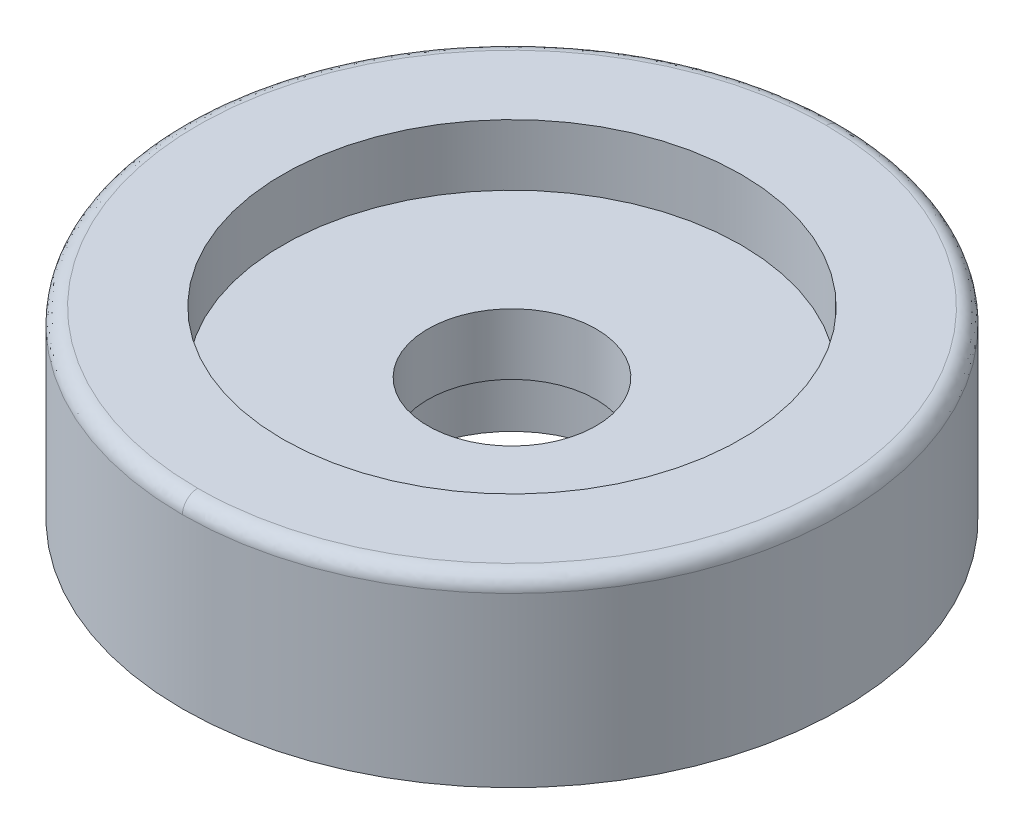
ISO-10303-21;
HEADER;
FILE_DESCRIPTION(('STEP AP214'),'2;1');
FILE_NAME('part.step','',(''),(''),'','','');
FILE_SCHEMA(('AUTOMOTIVE_DESIGN { 1 0 10303 214 1 1 1 1 }'));
ENDSEC;
DATA;
#1=APPLICATION_CONTEXT('core data for automotive mechanical design processes');
#2=APPLICATION_PROTOCOL_DEFINITION('international standard','automotive_design',2000,#1);
#3=PRODUCT_CONTEXT('',#1,'mechanical');
#4=PRODUCT('Part','Part','',(#3));
#5=PRODUCT_RELATED_PRODUCT_CATEGORY('part','',(#4));
#6=PRODUCT_DEFINITION_FORMATION('','',#4);
#7=PRODUCT_DEFINITION_CONTEXT('part definition',#1,'design');
#8=PRODUCT_DEFINITION('design','',#6,#7);
#9=PRODUCT_DEFINITION_SHAPE('','',#8);
#10=(LENGTH_UNIT() NAMED_UNIT(*) SI_UNIT(.MILLI.,.METRE.));
#11=(NAMED_UNIT(*) PLANE_ANGLE_UNIT() SI_UNIT($,.RADIAN.));
#12=(NAMED_UNIT(*) SI_UNIT($,.STERADIAN.) SOLID_ANGLE_UNIT());
#13=UNCERTAINTY_MEASURE_WITH_UNIT(LENGTH_MEASURE(1.E-05),#10,'distance_accuracy_value','');
#14=(GEOMETRIC_REPRESENTATION_CONTEXT(3) GLOBAL_UNCERTAINTY_ASSIGNED_CONTEXT((#13)) GLOBAL_UNIT_ASSIGNED_CONTEXT((#10,
#11,#12)) REPRESENTATION_CONTEXT('',''));
#15=CARTESIAN_POINT('',(0.,0.,0.));
#16=DIRECTION('',(0.,0.,1.));
#17=DIRECTION('',(1.,0.,0.));
#18=AXIS2_PLACEMENT_3D('',#15,#16,#17);
#19=CARTESIAN_POINT('',(-8.9838276,-10.16,8.9838276));
#20=DIRECTION('',(0.,-1.,0.));
#21=DIRECTION('',(0.,0.,-1.));
#22=AXIS2_PLACEMENT_3D('',#19,#20,#21);
#23=PLANE('',#22);
#24=CARTESIAN_POINT('',(0.,-10.16,0.));
#25=DIRECTION('',(0.,-1.,0.));
#26=DIRECTION('',(0.,0.,-1.));
#27=AXIS2_PLACEMENT_3D('',#24,#25,#26);
#28=CIRCLE('',#27,6.985);
#29=CARTESIAN_POINT('',(0.,-10.16,-6.985));
#30=VERTEX_POINT('',#29);
#31=EDGE_CURVE('E22',#30,#30,#28,.T.);
#32=ORIENTED_EDGE('',*,*,#31,.F.);
#33=EDGE_LOOP('',(#32));
#34=FACE_BOUND('',#33,.T.);
#35=CARTESIAN_POINT('',(0.,-10.16,0.));
#36=DIRECTION('',(0.,-1.,0.));
#37=DIRECTION('',(0.,0.,-1.));
#38=AXIS2_PLACEMENT_3D('',#35,#36,#37);
#39=CIRCLE('',#38,8.8773);
#40=CARTESIAN_POINT('',(0.,-10.16,-8.8773));
#41=VERTEX_POINT('',#40);
#42=EDGE_CURVE('E135',#41,#41,#39,.F.);
#43=ORIENTED_EDGE('',*,*,#42,.F.);
#44=EDGE_LOOP('',(#43));
#45=FACE_BOUND('',#44,.T.);
#46=ADVANCED_FACE('F17',(#34,#45),#23,.T.);
#47=CARTESIAN_POINT('',(0.,-5.08,0.));
#48=DIRECTION('',(0.,-1.,0.));
#49=DIRECTION('',(0.,0.,-1.));
#50=AXIS2_PLACEMENT_3D('',#47,#48,#49);
#51=CYLINDRICAL_SURFACE('',#50,6.985);
#52=CARTESIAN_POINT('',(0.,-5.08,0.));
#53=DIRECTION('',(0.,-1.,0.));
#54=DIRECTION('',(0.,0.,-1.));
#55=AXIS2_PLACEMENT_3D('',#52,#53,#54);
#56=CIRCLE('',#55,6.985);
#57=CARTESIAN_POINT('',(0.,-5.08,-6.985));
#58=VERTEX_POINT('',#57);
#59=EDGE_CURVE('E133',#58,#58,#56,.T.);
#60=ORIENTED_EDGE('',*,*,#59,.F.);
#61=EDGE_LOOP('',(#60));
#62=FACE_BOUND('',#61,.T.);
#63=ORIENTED_EDGE('',*,*,#31,.T.);
#64=EDGE_LOOP('',(#63));
#65=FACE_BOUND('',#64,.T.);
#66=ADVANCED_FACE('F142',(#62,#65),#51,.F.);
#67=CARTESIAN_POINT('',(0.,-10.16,0.));
#68=DIRECTION('',(0.,-1.,0.));
#69=DIRECTION('',(0.,0.,-1.));
#70=AXIS2_PLACEMENT_3D('',#67,#68,#69);
#71=CYLINDRICAL_SURFACE('',#70,8.8773);
#72=ORIENTED_EDGE('',*,*,#42,.T.);
#73=EDGE_LOOP('',(#72));
#74=FACE_BOUND('',#73,.T.);
#75=CARTESIAN_POINT('',(0.,-15.24,0.));
#76=DIRECTION('',(0.,-1.,0.));
#77=DIRECTION('',(0.,0.,-1.));
#78=AXIS2_PLACEMENT_3D('',#75,#76,#77);
#79=CIRCLE('',#78,8.8773);
#80=CARTESIAN_POINT('',(0.,-15.24,-8.8773));
#81=VERTEX_POINT('',#80);
#82=EDGE_CURVE('E130',#81,#81,#79,.T.);
#83=ORIENTED_EDGE('',*,*,#82,.T.);
#84=EDGE_LOOP('',(#83));
#85=FACE_BOUND('',#84,.T.);
#86=ADVANCED_FACE('F151',(#74,#85),#71,.F.);
#87=CARTESIAN_POINT('',(-19.2786,-5.08,-19.2786));
#88=DIRECTION('',(0.,1.,0.));
#89=DIRECTION('',(0.,0.,1.));
#90=AXIS2_PLACEMENT_3D('',#87,#88,#89);
#91=PLANE('',#90);
#92=ORIENTED_EDGE('',*,*,#59,.T.);
#93=EDGE_LOOP('',(#92));
#94=FACE_BOUND('',#93,.T.);
#95=CARTESIAN_POINT('',(0.,-5.08,0.));
#96=DIRECTION('',(0.,1.,0.));
#97=DIRECTION('',(0.,0.,1.));
#98=AXIS2_PLACEMENT_3D('',#95,#96,#97);
#99=CIRCLE('',#98,19.05);
#100=CARTESIAN_POINT('',(0.,-5.08,19.05));
#101=VERTEX_POINT('',#100);
#102=EDGE_CURVE('E127',#101,#101,#99,.F.);
#103=ORIENTED_EDGE('',*,*,#102,.F.);
#104=EDGE_LOOP('',(#103));
#105=FACE_BOUND('',#104,.T.);
#106=ADVANCED_FACE('F156',(#94,#105),#91,.T.);
#107=CARTESIAN_POINT('',(-27.7097744,-15.24,-27.7097744));
#108=DIRECTION('',(0.,1.,0.));
#109=DIRECTION('',(0.,0.,1.));
#110=AXIS2_PLACEMENT_3D('',#107,#108,#109);
#111=PLANE('',#110);
#112=ORIENTED_EDGE('',*,*,#82,.F.);
#113=EDGE_LOOP('',(#112));
#114=FACE_BOUND('',#113,.T.);
#115=CARTESIAN_POINT('',(0.,-15.24,0.));
#116=DIRECTION('',(0.,1.,0.));
#117=DIRECTION('',(0.,0.,1.));
#118=AXIS2_PLACEMENT_3D('',#115,#116,#117);
#119=CIRCLE('',#118,27.3812);
#120=CARTESIAN_POINT('',(0.,-15.24,27.3812));
#121=VERTEX_POINT('',#120);
#122=EDGE_CURVE('E124',#121,#121,#119,.F.);
#123=ORIENTED_EDGE('',*,*,#122,.T.);
#124=EDGE_LOOP('',(#123));
#125=FACE_BOUND('',#124,.T.);
#126=ADVANCED_FACE('F158',(#114,#125),#111,.F.);
#127=CARTESIAN_POINT('',(0.,-5.08,0.));
#128=DIRECTION('',(0.,1.,0.));
#129=DIRECTION('',(0.,0.,1.));
#130=AXIS2_PLACEMENT_3D('',#127,#128,#129);
#131=CYLINDRICAL_SURFACE('',#130,19.05);
#132=CARTESIAN_POINT('',(0.,0.,0.));
#133=DIRECTION('',(0.,1.,0.));
#134=DIRECTION('',(0.,0.,1.));
#135=AXIS2_PLACEMENT_3D('',#132,#133,#134);
#136=CIRCLE('',#135,19.05);
#137=CARTESIAN_POINT('',(0.,0.,19.05));
#138=VERTEX_POINT('',#137);
#139=EDGE_CURVE('E58',#138,#138,#136,.F.);
#140=ORIENTED_EDGE('',*,*,#139,.F.);
#141=EDGE_LOOP('',(#140));
#142=FACE_BOUND('',#141,.T.);
#143=ORIENTED_EDGE('',*,*,#102,.T.);
#144=EDGE_LOOP('',(#143));
#145=FACE_BOUND('',#144,.T.);
#146=ADVANCED_FACE('F161',(#142,#145),#131,.F.);
#147=CARTESIAN_POINT('',(0.,-15.24,0.));
#148=DIRECTION('',(0.,1.,0.));
#149=DIRECTION('',(0.,0.,1.));
#150=AXIS2_PLACEMENT_3D('',#147,#148,#149);
#151=CYLINDRICAL_SURFACE('',#150,27.3812);
#152=CARTESIAN_POINT('',(0.,-1.26999999926636,0.));
#153=DIRECTION('',(0.,1.,0.));
#154=DIRECTION('',(-1.,0.,0.));
#155=AXIS2_PLACEMENT_3D('',#152,#153,#154);
#156=CIRCLE('',#155,27.381200000103);
#157=CARTESIAN_POINT('',(0.,-1.26999999926636,27.3812000000772));
#158=VERTEX_POINT('',#157);
#159=CARTESIAN_POINT('',(-2.80798899843199E-09,-1.26999999944977,-27.3812000000772));
#160=VERTEX_POINT('',#159);
#161=EDGE_CURVE('E48',#158,#160,#156,.T.);
#162=ORIENTED_EDGE('',*,*,#161,.F.);
#163=CARTESIAN_POINT('',(0.,-1.26999999926636,0.));
#164=DIRECTION('',(0.,1.,0.));
#165=DIRECTION('',(-1.,0.,0.));
#166=AXIS2_PLACEMENT_3D('',#163,#164,#165);
#167=CIRCLE('',#166,27.381200000103);
#168=EDGE_CURVE('E45',#160,#158,#167,.T.);
#169=ORIENTED_EDGE('',*,*,#168,.F.);
#170=EDGE_LOOP('',(#162,#169));
#171=FACE_BOUND('',#170,.T.);
#172=ORIENTED_EDGE('',*,*,#122,.F.);
#173=EDGE_LOOP('',(#172));
#174=FACE_BOUND('',#173,.T.);
#175=ADVANCED_FACE('F49',(#171,#174),#151,.T.);
#176=CARTESIAN_POINT('',(-26.4245344,0.,-26.4245344));
#177=DIRECTION('',(0.,1.,0.));
#178=DIRECTION('',(0.,0.,1.));
#179=AXIS2_PLACEMENT_3D('',#176,#177,#178);
#180=PLANE('',#179);
#181=ORIENTED_EDGE('',*,*,#139,.T.);
#182=EDGE_LOOP('',(#181));
#183=FACE_BOUND('',#182,.T.);
#184=CARTESIAN_POINT('',(0.,1.02975377892333E-10,-26.1112000007338));
#185=CARTESIAN_POINT('',(52.2224000014676,1.029753905046E-10,-26.1112000007338));
#186=CARTESIAN_POINT('',(52.2224000014676,1.029753905046E-10,26.1112000007338));
#187=CARTESIAN_POINT('',(0.,1.02975377892333E-10,26.1112000007338));
#188=(BOUNDED_CURVE() B_SPLINE_CURVE(3,(#184,#185,#186,#187),.UNSPECIFIED.,.F.,
.F.) B_SPLINE_CURVE_WITH_KNOTS((4,4),(0.,1.),
.UNSPECIFIED.) CURVE() GEOMETRIC_REPRESENTATION_ITEM() RATIONAL_B_SPLINE_CURVE((0.956578302165953,
0.318859434055318,0.318859434055318,0.956578302165953)) REPRESENTATION_ITEM(''));
#189=CARTESIAN_POINT('',(0.,6.17852270873015E-11,-26.1111999952598));
#190=VERTEX_POINT('',#189);
#191=CARTESIAN_POINT('',(0.,6.17852271716624E-11,26.1111999952598));
#192=VERTEX_POINT('',#191);
#193=EDGE_CURVE('E28',#190,#192,#188,.T.);
#194=ORIENTED_EDGE('',*,*,#193,.F.);
#195=CARTESIAN_POINT('',(0.,1.02975377415524E-10,26.1112000007338));
#196=CARTESIAN_POINT('',(-52.2224000014675,1.02975389812274E-10,26.1112000007338));
#197=CARTESIAN_POINT('',(-52.2224000014675,1.02975389812274E-10,-26.1112000007338));
#198=CARTESIAN_POINT('',(0.,1.02975377415524E-10,-26.1112000007338));
#199=(BOUNDED_CURVE() B_SPLINE_CURVE(3,(#195,#196,#197,#198),.UNSPECIFIED.,.F.,
.F.) B_SPLINE_CURVE_WITH_KNOTS((4,4),(0.,1.),
.UNSPECIFIED.) CURVE() GEOMETRIC_REPRESENTATION_ITEM() RATIONAL_B_SPLINE_CURVE((0.956578302165956,
0.318859434055319,0.318859434055319,0.956578302165956)) REPRESENTATION_ITEM(''));
#200=EDGE_CURVE('E36',#192,#190,#199,.T.);
#201=ORIENTED_EDGE('',*,*,#200,.F.);
#202=EDGE_LOOP('',(#194,#201));
#203=FACE_BOUND('',#202,.T.);
#204=ADVANCED_FACE('F19',(#183,#203),#180,.T.);
#205=CARTESIAN_POINT('',(0.,-0.00634471,-25.984411561));
#206=CARTESIAN_POINT('',(-51.968823122,-0.00634471,-25.984411561));
#207=CARTESIAN_POINT('',(-51.968823122,-0.00634471,25.984411561));
#208=CARTESIAN_POINT('',(0.,-0.00634471,25.984411561));
#209=CARTESIAN_POINT('',(0.,0.080289937,-26.847868282));
#210=CARTESIAN_POINT('',(-53.695736564,0.080289937,-26.847868282));
#211=CARTESIAN_POINT('',(-53.695736564,0.080289937,26.847868282));
#212=CARTESIAN_POINT('',(0.,0.080289937,26.847868282));
#213=CARTESIAN_POINT('',(0.,-0.533331718,-27.461489937));
#214=CARTESIAN_POINT('',(-54.922979874,-0.533331718,-27.461489937));
#215=CARTESIAN_POINT('',(-54.922979874,-0.533331718,27.461489937));
#216=CARTESIAN_POINT('',(0.,-0.533331718,27.461489937));
#217=CARTESIAN_POINT('',(0.,-1.396788439,-27.37485529));
#218=CARTESIAN_POINT('',(-54.74971058,-1.396788439,-27.37485529));
#219=CARTESIAN_POINT('',(-54.74971058,-1.396788439,27.37485529));
#220=CARTESIAN_POINT('',(0.,-1.396788439,27.37485529));
#221=(BOUNDED_SURFACE() B_SPLINE_SURFACE(3,3,((#205,#206,#207,#208),(#209,#210,#211,#212),(#213,
#214,#215,#216),(#217,#218,#219,#220)),.UNSPECIFIED.,.F.,.F.,
.F.) B_SPLINE_SURFACE_WITH_KNOTS((4,4),(4,4),(0.,1.),(0.,1.),
.UNSPECIFIED.) GEOMETRIC_REPRESENTATION_ITEM() RATIONAL_B_SPLINE_SURFACE(((1.,0.333333333333333,
0.333333333333333,1.),(0.755320871117972,0.251773623705991,0.251773623705991,0.755320871117972),
(0.755320871117972,0.251773623705991,0.251773623705991,0.755320871117972),(1.,0.333333333333333,
0.333333333333333,1.))) REPRESENTATION_ITEM('') SURFACE());
#222=CARTESIAN_POINT('',(0.,-0.00634471,25.984411561));
#223=CARTESIAN_POINT('',(0.,0.080289937,26.847868282));
#224=CARTESIAN_POINT('',(0.,-0.533331718,27.461489937));
#225=CARTESIAN_POINT('',(0.,-1.396788439,27.37485529));
#226=(BOUNDED_CURVE() B_SPLINE_CURVE(3,(#222,#223,#224,#225),.UNSPECIFIED.,.F.,
.F.) B_SPLINE_CURVE_WITH_KNOTS((4,4),(0.,1.),
.UNSPECIFIED.) CURVE() GEOMETRIC_REPRESENTATION_ITEM() RATIONAL_B_SPLINE_CURVE((1.,
0.755320871117972,0.755320871117972,1.)) REPRESENTATION_ITEM(''));
#227=EDGE_CURVE('E11',#192,#158,#226,.T.);
#228=CARTESIAN_POINT('',(0.,-0.00634471,-25.984411561));
#229=CARTESIAN_POINT('',(0.,0.080289937,-26.847868282));
#230=CARTESIAN_POINT('',(0.,-0.533331718,-27.461489937));
#231=CARTESIAN_POINT('',(0.,-1.396788439,-27.37485529));
#232=(BOUNDED_CURVE() B_SPLINE_CURVE(3,(#228,#229,#230,#231),.UNSPECIFIED.,.F.,
.F.) B_SPLINE_CURVE_WITH_KNOTS((4,4),(0.,1.),
.UNSPECIFIED.) CURVE() GEOMETRIC_REPRESENTATION_ITEM() RATIONAL_B_SPLINE_CURVE((1.,
0.755320871117972,0.755320871117972,1.)) REPRESENTATION_ITEM(''));
#233=EDGE_CURVE('E53',#160,#190,#232,.F.);
#234=ORIENTED_EDGE('',*,*,#227,.F.);
#235=ORIENTED_EDGE('',*,*,#200,.T.);
#236=ORIENTED_EDGE('',*,*,#233,.F.);
#237=ORIENTED_EDGE('',*,*,#168,.T.);
#238=EDGE_LOOP('',(#234,#235,#236,#237));
#239=FACE_BOUND('',#238,.T.);
#240=ADVANCED_FACE('F56',(#239),#221,.T.);
#241=CARTESIAN_POINT('',(0.,-0.00634471,25.984411561));
#242=CARTESIAN_POINT('',(51.968823122,-0.00634471,25.984411561));
#243=CARTESIAN_POINT('',(51.968823122,-0.00634471,-25.984411561));
#244=CARTESIAN_POINT('',(0.,-0.00634471,-25.984411561));
#245=CARTESIAN_POINT('',(0.,0.080289937,26.847868282));
#246=CARTESIAN_POINT('',(53.695736564,0.080289937,26.847868282));
#247=CARTESIAN_POINT('',(53.695736564,0.080289937,-26.847868282));
#248=CARTESIAN_POINT('',(0.,0.080289937,-26.847868282));
#249=CARTESIAN_POINT('',(0.,-0.533331718,27.461489937));
#250=CARTESIAN_POINT('',(54.922979874,-0.533331718,27.461489937));
#251=CARTESIAN_POINT('',(54.922979874,-0.533331718,-27.461489937));
#252=CARTESIAN_POINT('',(0.,-0.533331718,-27.461489937));
#253=CARTESIAN_POINT('',(0.,-1.396788439,27.37485529));
#254=CARTESIAN_POINT('',(54.74971058,-1.396788439,27.37485529));
#255=CARTESIAN_POINT('',(54.74971058,-1.396788439,-27.37485529));
#256=CARTESIAN_POINT('',(0.,-1.396788439,-27.37485529));
#257=(BOUNDED_SURFACE() B_SPLINE_SURFACE(3,3,((#241,#242,#243,#244),(#245,#246,#247,#248),(#249,
#250,#251,#252),(#253,#254,#255,#256)),.UNSPECIFIED.,.F.,.F.,
.F.) B_SPLINE_SURFACE_WITH_KNOTS((4,4),(4,4),(0.,1.),(0.,1.),
.UNSPECIFIED.) GEOMETRIC_REPRESENTATION_ITEM() RATIONAL_B_SPLINE_SURFACE(((1.,0.333333333333333,
0.333333333333333,1.),(0.755320871117972,0.251773623705991,0.251773623705991,0.755320871117972),
(0.755320871117972,0.251773623705991,0.251773623705991,0.755320871117972),(1.,0.333333333333333,
0.333333333333333,1.))) REPRESENTATION_ITEM('') SURFACE());
#258=ORIENTED_EDGE('',*,*,#193,.T.);
#259=ORIENTED_EDGE('',*,*,#227,.T.);
#260=ORIENTED_EDGE('',*,*,#161,.T.);
#261=ORIENTED_EDGE('',*,*,#233,.T.);
#262=EDGE_LOOP('',(#258,#259,#260,#261));
#263=FACE_BOUND('',#262,.T.);
#264=ADVANCED_FACE('F60',(#263),#257,.T.);
#265=CLOSED_SHELL('',(#46,#66,#86,#106,#126,#146,#175,#204,#240,#264));
#266=MANIFOLD_SOLID_BREP('B1',#265);
#267=ADVANCED_BREP_SHAPE_REPRESENTATION('',(#18,#266),#14);
#268=SHAPE_DEFINITION_REPRESENTATION(#9,#267);
ENDSEC;
END-ISO-10303-21;
